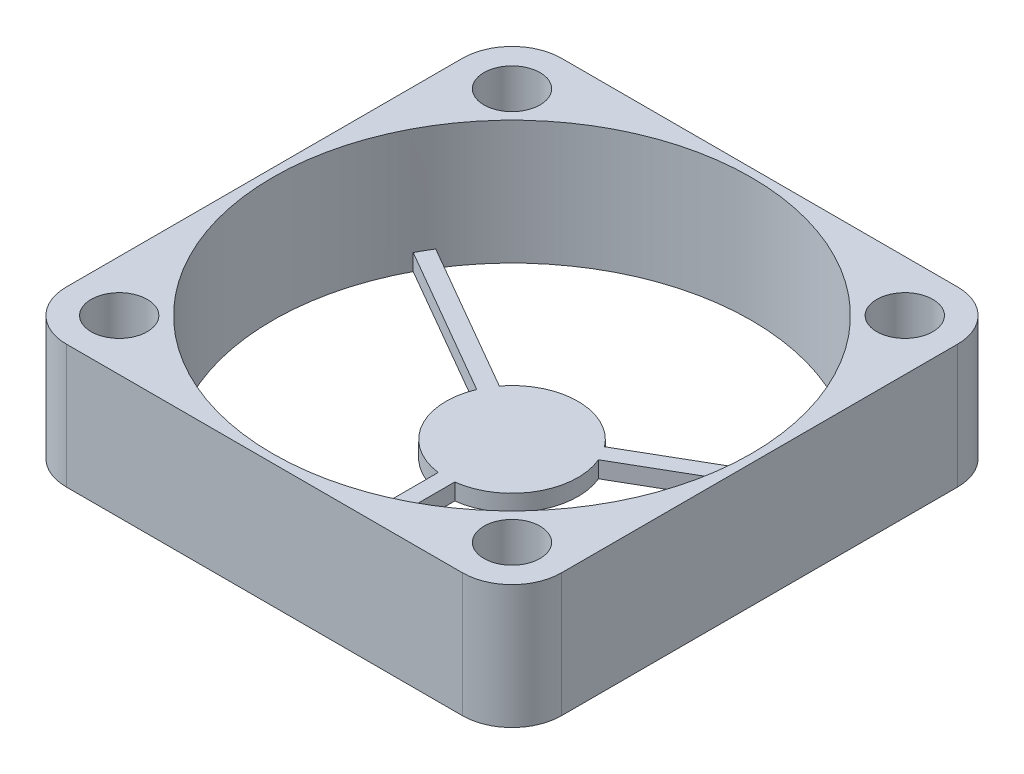
ISO-10303-21;
HEADER;
FILE_DESCRIPTION(('STEP AP214'),'2;1');
FILE_NAME('part.step','',(''),(''),'','','');
FILE_SCHEMA(('AUTOMOTIVE_DESIGN { 1 0 10303 214 1 1 1 1 }'));
ENDSEC;
DATA;
#1=APPLICATION_CONTEXT('core data for automotive mechanical design processes');
#2=APPLICATION_PROTOCOL_DEFINITION('international standard','automotive_design',2000,#1);
#3=PRODUCT_CONTEXT('',#1,'mechanical');
#4=PRODUCT('Part','Part','',(#3));
#5=PRODUCT_RELATED_PRODUCT_CATEGORY('part','',(#4));
#6=PRODUCT_DEFINITION_FORMATION('','',#4);
#7=PRODUCT_DEFINITION_CONTEXT('part definition',#1,'design');
#8=PRODUCT_DEFINITION('design','',#6,#7);
#9=PRODUCT_DEFINITION_SHAPE('','',#8);
#10=(LENGTH_UNIT() NAMED_UNIT(*) SI_UNIT(.MILLI.,.METRE.));
#11=(NAMED_UNIT(*) PLANE_ANGLE_UNIT() SI_UNIT($,.RADIAN.));
#12=(NAMED_UNIT(*) SI_UNIT($,.STERADIAN.) SOLID_ANGLE_UNIT());
#13=UNCERTAINTY_MEASURE_WITH_UNIT(LENGTH_MEASURE(1.E-05),#10,'distance_accuracy_value','');
#14=(GEOMETRIC_REPRESENTATION_CONTEXT(3) GLOBAL_UNCERTAINTY_ASSIGNED_CONTEXT((#13)) GLOBAL_UNIT_ASSIGNED_CONTEXT((#10,
#11,#12)) REPRESENTATION_CONTEXT('',''));
#15=CARTESIAN_POINT('',(0.,0.,0.));
#16=DIRECTION('',(0.,0.,1.));
#17=DIRECTION('',(1.,0.,0.));
#18=AXIS2_PLACEMENT_3D('',#15,#16,#17);
#19=CARTESIAN_POINT('',(0.,1.,0.));
#20=DIRECTION('',(0.,-1.,0.));
#21=DIRECTION('',(0.,0.,-1.));
#22=AXIS2_PLACEMENT_3D('',#19,#20,#21);
#23=CYLINDRICAL_SURFACE('',#22,4.);
#24=DIRECTION('',(0.,-1.,0.));
#25=VECTOR('',#24,1.);
#26=CARTESIAN_POINT('',(-3.68693177121545,12.3997456189822,-1.55130078140374));
#27=LINE('',#26,#25);
#28=CARTESIAN_POINT('',(-3.68693177121755,1.,-1.55130078140462));
#29=VERTEX_POINT('',#28);
#30=CARTESIAN_POINT('',(-3.68693177121755,0.,-1.55130078140462));
#31=VERTEX_POINT('',#30);
#32=EDGE_CURVE('E55',#29,#31,#27,.T.);
#33=ORIENTED_EDGE('',*,*,#32,.T.);
#34=CARTESIAN_POINT('',(0.,0.,0.));
#35=DIRECTION('',(0.,-1.,0.));
#36=DIRECTION('',(0.,0.,-1.));
#37=AXIS2_PLACEMENT_3D('',#34,#35,#36);
#38=CIRCLE('',#37,4.);
#39=CARTESIAN_POINT('',(-0.5,0.,3.96862696659689));
#40=VERTEX_POINT('',#39);
#41=EDGE_CURVE('E222',#40,#31,#38,.T.);
#42=ORIENTED_EDGE('',*,*,#41,.F.);
#43=DIRECTION('',(0.,-1.,0.));
#44=VECTOR('',#43,1.);
#45=CARTESIAN_POINT('',(-0.5,12.3997456189822,3.96862696659689));
#46=LINE('',#45,#44);
#47=CARTESIAN_POINT('',(-0.5,1.,3.96862696659689));
#48=VERTEX_POINT('',#47);
#49=EDGE_CURVE('E242',#48,#40,#46,.T.);
#50=ORIENTED_EDGE('',*,*,#49,.F.);
#51=CARTESIAN_POINT('',(0.,1.,0.));
#52=DIRECTION('',(0.,-1.,0.));
#53=DIRECTION('',(0.,0.,-1.));
#54=AXIS2_PLACEMENT_3D('',#51,#52,#53);
#55=CIRCLE('',#54,4.);
#56=EDGE_CURVE('E181',#48,#29,#55,.T.);
#57=ORIENTED_EDGE('',*,*,#56,.T.);
#58=EDGE_LOOP('',(#33,#42,#50,#57));
#59=FACE_BOUND('',#58,.T.);
#60=ADVANCED_FACE('F32',(#59),#23,.T.);
#61=DIRECTION('',(0.,-1.,0.));
#62=VECTOR('',#61,1.);
#63=CARTESIAN_POINT('',(-3.18693177121544,12.3997456189822,-2.41732618518819));
#64=LINE('',#63,#62);
#65=CARTESIAN_POINT('',(-3.18693177121544,1.,-2.41732618518819));
#66=VERTEX_POINT('',#65);
#67=CARTESIAN_POINT('',(-3.18693177121775,0.,-2.41732618518952));
#68=VERTEX_POINT('',#67);
#69=EDGE_CURVE('E184',#66,#68,#64,.T.);
#70=ORIENTED_EDGE('',*,*,#69,.F.);
#71=CARTESIAN_POINT('',(3.18693177121775,1.,-2.41732618518952));
#72=VERTEX_POINT('',#71);
#73=EDGE_CURVE('E170',#66,#72,#55,.T.);
#74=ORIENTED_EDGE('',*,*,#73,.T.);
#75=DIRECTION('',(0.,-1.,0.));
#76=VECTOR('',#75,1.);
#77=CARTESIAN_POINT('',(3.18693177121545,12.3997456189822,-2.41732618518819));
#78=LINE('',#77,#76);
#79=CARTESIAN_POINT('',(3.18693177121755,0.,-2.41732618518978));
#80=VERTEX_POINT('',#79);
#81=EDGE_CURVE('E212',#72,#80,#78,.T.);
#82=ORIENTED_EDGE('',*,*,#81,.T.);
#83=EDGE_CURVE('E47',#68,#80,#38,.T.);
#84=ORIENTED_EDGE('',*,*,#83,.F.);
#85=EDGE_LOOP('',(#70,#74,#82,#84));
#86=FACE_BOUND('',#85,.T.);
#87=ADVANCED_FACE('F185',(#86),#23,.T.);
#88=CARTESIAN_POINT('',(-12.,7.5,12.));
#89=DIRECTION('',(0.,-1.,0.));
#90=DIRECTION('',(0.,0.,-1.));
#91=AXIS2_PLACEMENT_3D('',#88,#89,#90);
#92=PLANE('',#91);
#93=CARTESIAN_POINT('',(0.,7.5,0.));
#94=DIRECTION('',(0.,1.,0.));
#95=DIRECTION('',(0.,0.,1.));
#96=AXIS2_PLACEMENT_3D('',#93,#94,#95);
#97=CIRCLE('',#96,14.5);
#98=CARTESIAN_POINT('',(0.,7.5,14.5));
#99=VERTEX_POINT('',#98);
#100=EDGE_CURVE('E249',#99,#99,#97,.T.);
#101=ORIENTED_EDGE('',*,*,#100,.F.);
#102=EDGE_LOOP('',(#101));
#103=FACE_BOUND('',#102,.T.);
#104=CARTESIAN_POINT('',(-12.,7.5,12.));
#105=DIRECTION('',(0.,1.,0.));
#106=DIRECTION('',(0.,0.,-1.));
#107=AXIS2_PLACEMENT_3D('',#104,#105,#106);
#108=CIRCLE('',#107,3.);
#109=CARTESIAN_POINT('',(-15.,7.5,12.));
#110=VERTEX_POINT('',#109);
#111=CARTESIAN_POINT('',(-12.,7.5,15.));
#112=VERTEX_POINT('',#111);
#113=EDGE_CURVE('E282',#110,#112,#108,.T.);
#114=ORIENTED_EDGE('',*,*,#113,.T.);
#115=DIRECTION('',(1.,0.,0.));
#116=VECTOR('',#115,1.);
#117=CARTESIAN_POINT('',(-12.,7.5,15.));
#118=LINE('',#117,#116);
#119=CARTESIAN_POINT('',(12.,7.5,15.));
#120=VERTEX_POINT('',#119);
#121=EDGE_CURVE('E285',#112,#120,#118,.T.);
#122=ORIENTED_EDGE('',*,*,#121,.T.);
#123=CARTESIAN_POINT('',(12.,7.5,12.));
#124=DIRECTION('',(0.,1.,0.));
#125=DIRECTION('',(0.,0.,1.));
#126=AXIS2_PLACEMENT_3D('',#123,#124,#125);
#127=CIRCLE('',#126,3.);
#128=CARTESIAN_POINT('',(15.,7.5,12.));
#129=VERTEX_POINT('',#128);
#130=EDGE_CURVE('E288',#120,#129,#127,.T.);
#131=ORIENTED_EDGE('',*,*,#130,.T.);
#132=DIRECTION('',(0.,0.,-1.));
#133=VECTOR('',#132,1.);
#134=CARTESIAN_POINT('',(15.,7.5,12.));
#135=LINE('',#134,#133);
#136=CARTESIAN_POINT('',(15.,7.5,-12.));
#137=VERTEX_POINT('',#136);
#138=EDGE_CURVE('E290',#129,#137,#135,.T.);
#139=ORIENTED_EDGE('',*,*,#138,.T.);
#140=CARTESIAN_POINT('',(12.,7.5,-12.));
#141=DIRECTION('',(0.,1.,0.));
#142=DIRECTION('',(0.,0.,1.));
#143=AXIS2_PLACEMENT_3D('',#140,#141,#142);
#144=CIRCLE('',#143,3.);
#145=CARTESIAN_POINT('',(12.,7.5,-15.));
#146=VERTEX_POINT('',#145);
#147=EDGE_CURVE('E292',#137,#146,#144,.T.);
#148=ORIENTED_EDGE('',*,*,#147,.T.);
#149=DIRECTION('',(-1.,0.,0.));
#150=VECTOR('',#149,1.);
#151=CARTESIAN_POINT('',(-12.,7.5,-15.));
#152=LINE('',#151,#150);
#153=CARTESIAN_POINT('',(-12.,7.5,-15.));
#154=VERTEX_POINT('',#153);
#155=EDGE_CURVE('E294',#146,#154,#152,.T.);
#156=ORIENTED_EDGE('',*,*,#155,.T.);
#157=CARTESIAN_POINT('',(-12.,7.5,-12.));
#158=DIRECTION('',(0.,1.,0.));
#159=DIRECTION('',(0.,0.,1.));
#160=AXIS2_PLACEMENT_3D('',#157,#158,#159);
#161=CIRCLE('',#160,3.);
#162=CARTESIAN_POINT('',(-15.,7.5,-12.));
#163=VERTEX_POINT('',#162);
#164=EDGE_CURVE('E296',#154,#163,#161,.T.);
#165=ORIENTED_EDGE('',*,*,#164,.T.);
#166=DIRECTION('',(0.,0.,1.));
#167=VECTOR('',#166,1.);
#168=CARTESIAN_POINT('',(-15.,7.5,12.));
#169=LINE('',#168,#167);
#170=EDGE_CURVE('E298',#163,#110,#169,.T.);
#171=ORIENTED_EDGE('',*,*,#170,.T.);
#172=EDGE_LOOP('',(#114,#122,#131,#139,#148,#156,#165,#171));
#173=FACE_BOUND('',#172,.T.);
#174=CARTESIAN_POINT('',(-11.9,7.5,-11.9));
#175=DIRECTION('',(0.,1.,0.));
#176=DIRECTION('',(0.,0.,1.));
#177=AXIS2_PLACEMENT_3D('',#174,#175,#176);
#178=CIRCLE('',#177,1.7);
#179=CARTESIAN_POINT('',(-11.9,7.5,-10.2));
#180=VERTEX_POINT('',#179);
#181=EDGE_CURVE('E276',#180,#180,#178,.T.);
#182=ORIENTED_EDGE('',*,*,#181,.F.);
#183=EDGE_LOOP('',(#182));
#184=FACE_BOUND('',#183,.T.);
#185=CARTESIAN_POINT('',(11.9,7.5,-11.9));
#186=DIRECTION('',(0.,1.,0.));
#187=DIRECTION('',(0.,0.,1.));
#188=AXIS2_PLACEMENT_3D('',#185,#186,#187);
#189=CIRCLE('',#188,1.7);
#190=CARTESIAN_POINT('',(11.9,7.5,-10.2));
#191=VERTEX_POINT('',#190);
#192=EDGE_CURVE('E270',#191,#191,#189,.T.);
#193=ORIENTED_EDGE('',*,*,#192,.F.);
#194=EDGE_LOOP('',(#193));
#195=FACE_BOUND('',#194,.T.);
#196=CARTESIAN_POINT('',(11.9,7.5,11.9));
#197=DIRECTION('',(0.,1.,0.));
#198=DIRECTION('',(0.,0.,1.));
#199=AXIS2_PLACEMENT_3D('',#196,#197,#198);
#200=CIRCLE('',#199,1.7);
#201=CARTESIAN_POINT('',(11.9,7.5,13.6));
#202=VERTEX_POINT('',#201);
#203=EDGE_CURVE('E264',#202,#202,#200,.T.);
#204=ORIENTED_EDGE('',*,*,#203,.F.);
#205=EDGE_LOOP('',(#204));
#206=FACE_BOUND('',#205,.T.);
#207=CARTESIAN_POINT('',(-11.9,7.5,11.9));
#208=DIRECTION('',(0.,1.,0.));
#209=DIRECTION('',(0.,0.,1.));
#210=AXIS2_PLACEMENT_3D('',#207,#208,#209);
#211=CIRCLE('',#210,1.7);
#212=CARTESIAN_POINT('',(-11.9,7.5,13.6));
#213=VERTEX_POINT('',#212);
#214=EDGE_CURVE('E258',#213,#213,#211,.T.);
#215=ORIENTED_EDGE('',*,*,#214,.F.);
#216=EDGE_LOOP('',(#215));
#217=FACE_BOUND('',#216,.T.);
#218=ADVANCED_FACE('F357',(#103,#173,#184,#195,#206,#217),#92,.F.);
#219=CARTESIAN_POINT('',(-12.,0.,12.));
#220=DIRECTION('',(0.,-1.,0.));
#221=DIRECTION('',(0.,0.,-1.));
#222=AXIS2_PLACEMENT_3D('',#219,#220,#221);
#223=PLANE('',#222);
#224=ORIENTED_EDGE('',*,*,#41,.T.);
#225=DIRECTION('',(-0.866025403784438,0.,-0.5));
#226=VECTOR('',#225,1.);
#227=CARTESIAN_POINT('',(-12.7999003980097,0.,-6.81267567120002));
#228=LINE('',#227,#226);
#229=CARTESIAN_POINT('',(-12.7999003980118,0.,-6.81267567120116));
#230=VERTEX_POINT('',#229);
#231=EDGE_CURVE('E426',#31,#230,#228,.T.);
#232=ORIENTED_EDGE('',*,*,#231,.T.);
#233=CARTESIAN_POINT('',(0.,0.,0.));
#234=DIRECTION('',(0.,1.,0.));
#235=DIRECTION('',(0.,0.,1.));
#236=AXIS2_PLACEMENT_3D('',#233,#234,#235);
#237=CIRCLE('',#236,14.5);
#238=CARTESIAN_POINT('',(-0.5,0.,14.4913767461894));
#239=VERTEX_POINT('',#238);
#240=EDGE_CURVE('E255',#230,#239,#237,.T.);
#241=ORIENTED_EDGE('',*,*,#240,.T.);
#242=DIRECTION('',(0.,0.,-1.));
#243=VECTOR('',#242,1.);
#244=CARTESIAN_POINT('',(-0.5,0.,14.4913767461894));
#245=LINE('',#244,#243);
#246=EDGE_CURVE('E221',#239,#40,#245,.T.);
#247=ORIENTED_EDGE('',*,*,#246,.T.);
#248=EDGE_LOOP('',(#224,#232,#241,#247));
#249=FACE_BOUND('',#248,.T.);
#250=CARTESIAN_POINT('',(0.499999999999986,0.,14.4913767461894));
#251=VERTEX_POINT('',#250);
#252=CARTESIAN_POINT('',(12.7999003980119,0.,-6.81267567120116));
#253=VERTEX_POINT('',#252);
#254=EDGE_CURVE('E250',#251,#253,#237,.T.);
#255=ORIENTED_EDGE('',*,*,#254,.T.);
#256=DIRECTION('',(-0.866025403784439,0.,0.5));
#257=VECTOR('',#256,1.);
#258=CARTESIAN_POINT('',(12.7999003980097,0.,-6.81267567120002));
#259=LINE('',#258,#257);
#260=CARTESIAN_POINT('',(3.68693177121744,0.,-1.55130078140489));
#261=VERTEX_POINT('',#260);
#262=EDGE_CURVE('E192',#253,#261,#259,.T.);
#263=ORIENTED_EDGE('',*,*,#262,.T.);
#264=CARTESIAN_POINT('',(0.499999999999986,0.,3.96862696659689));
#265=VERTEX_POINT('',#264);
#266=EDGE_CURVE('E219',#261,#265,#38,.T.);
#267=ORIENTED_EDGE('',*,*,#266,.T.);
#268=DIRECTION('',(0.,0.,1.));
#269=VECTOR('',#268,1.);
#270=CARTESIAN_POINT('',(0.499999999999986,0.,14.4913767461894));
#271=LINE('',#270,#269);
#272=EDGE_CURVE('E233',#265,#251,#271,.T.);
#273=ORIENTED_EDGE('',*,*,#272,.T.);
#274=EDGE_LOOP('',(#255,#263,#267,#273));
#275=FACE_BOUND('',#274,.T.);
#276=DIRECTION('',(0.866025403784439,0.,-0.5));
#277=VECTOR('',#276,1.);
#278=CARTESIAN_POINT('',(12.2999003980097,0.,-7.67870107498447));
#279=LINE('',#278,#277);
#280=CARTESIAN_POINT('',(12.2999003980118,0.,-7.6787010749858));
#281=VERTEX_POINT('',#280);
#282=EDGE_CURVE('E196',#80,#281,#279,.T.);
#283=ORIENTED_EDGE('',*,*,#282,.T.);
#284=CARTESIAN_POINT('',(-12.2999003980118,0.,-7.67870107498581));
#285=VERTEX_POINT('',#284);
#286=EDGE_CURVE('E254',#281,#285,#237,.T.);
#287=ORIENTED_EDGE('',*,*,#286,.T.);
#288=DIRECTION('',(0.866025403784438,0.,0.5));
#289=VECTOR('',#288,1.);
#290=CARTESIAN_POINT('',(-12.2999003980097,0.,-7.67870107498447));
#291=LINE('',#290,#289);
#292=EDGE_CURVE('E418',#285,#68,#291,.T.);
#293=ORIENTED_EDGE('',*,*,#292,.T.);
#294=ORIENTED_EDGE('',*,*,#83,.T.);
#295=EDGE_LOOP('',(#283,#287,#293,#294));
#296=FACE_BOUND('',#295,.T.);
#297=CARTESIAN_POINT('',(11.9,0.,11.9));
#298=DIRECTION('',(0.,1.,0.));
#299=DIRECTION('',(0.,0.,1.));
#300=AXIS2_PLACEMENT_3D('',#297,#298,#299);
#301=CIRCLE('',#300,1.7);
#302=CARTESIAN_POINT('',(11.9,0.,13.6));
#303=VERTEX_POINT('',#302);
#304=EDGE_CURVE('E261',#303,#303,#301,.T.);
#305=ORIENTED_EDGE('',*,*,#304,.T.);
#306=EDGE_LOOP('',(#305));
#307=FACE_BOUND('',#306,.T.);
#308=CARTESIAN_POINT('',(-11.9,0.,-11.9));
#309=DIRECTION('',(0.,1.,0.));
#310=DIRECTION('',(0.,0.,1.));
#311=AXIS2_PLACEMENT_3D('',#308,#309,#310);
#312=CIRCLE('',#311,1.7);
#313=CARTESIAN_POINT('',(-11.9,0.,-10.2));
#314=VERTEX_POINT('',#313);
#315=EDGE_CURVE('E273',#314,#314,#312,.T.);
#316=ORIENTED_EDGE('',*,*,#315,.T.);
#317=EDGE_LOOP('',(#316));
#318=FACE_BOUND('',#317,.T.);
#319=CARTESIAN_POINT('',(-12.,0.,12.));
#320=DIRECTION('',(0.,1.,0.));
#321=DIRECTION('',(0.,0.,-1.));
#322=AXIS2_PLACEMENT_3D('',#319,#320,#321);
#323=CIRCLE('',#322,3.);
#324=CARTESIAN_POINT('',(-15.,0.,12.));
#325=VERTEX_POINT('',#324);
#326=CARTESIAN_POINT('',(-12.,0.,15.));
#327=VERTEX_POINT('',#326);
#328=EDGE_CURVE('E279',#325,#327,#323,.T.);
#329=ORIENTED_EDGE('',*,*,#328,.F.);
#330=DIRECTION('',(0.,0.,1.));
#331=VECTOR('',#330,1.);
#332=CARTESIAN_POINT('',(-15.,0.,12.));
#333=LINE('',#332,#331);
#334=CARTESIAN_POINT('',(-15.,0.,-12.));
#335=VERTEX_POINT('',#334);
#336=EDGE_CURVE('E286',#335,#325,#333,.T.);
#337=ORIENTED_EDGE('',*,*,#336,.F.);
#338=CARTESIAN_POINT('',(-12.,0.,-12.));
#339=DIRECTION('',(0.,1.,0.));
#340=DIRECTION('',(0.,0.,1.));
#341=AXIS2_PLACEMENT_3D('',#338,#339,#340);
#342=CIRCLE('',#341,3.);
#343=CARTESIAN_POINT('',(-12.,0.,-15.));
#344=VERTEX_POINT('',#343);
#345=EDGE_CURVE('E313',#344,#335,#342,.T.);
#346=ORIENTED_EDGE('',*,*,#345,.F.);
#347=DIRECTION('',(-1.,0.,0.));
#348=VECTOR('',#347,1.);
#349=CARTESIAN_POINT('',(-12.,0.,-15.));
#350=LINE('',#349,#348);
#351=CARTESIAN_POINT('',(12.,0.,-15.));
#352=VERTEX_POINT('',#351);
#353=EDGE_CURVE('E311',#352,#344,#350,.T.);
#354=ORIENTED_EDGE('',*,*,#353,.F.);
#355=CARTESIAN_POINT('',(12.,0.,-12.));
#356=DIRECTION('',(0.,1.,0.));
#357=DIRECTION('',(0.,0.,1.));
#358=AXIS2_PLACEMENT_3D('',#355,#356,#357);
#359=CIRCLE('',#358,3.);
#360=CARTESIAN_POINT('',(15.,0.,-12.));
#361=VERTEX_POINT('',#360);
#362=EDGE_CURVE('E309',#361,#352,#359,.T.);
#363=ORIENTED_EDGE('',*,*,#362,.F.);
#364=DIRECTION('',(0.,0.,-1.));
#365=VECTOR('',#364,1.);
#366=CARTESIAN_POINT('',(15.,0.,12.));
#367=LINE('',#366,#365);
#368=CARTESIAN_POINT('',(15.,0.,12.));
#369=VERTEX_POINT('',#368);
#370=EDGE_CURVE('E307',#369,#361,#367,.T.);
#371=ORIENTED_EDGE('',*,*,#370,.F.);
#372=CARTESIAN_POINT('',(12.,0.,12.));
#373=DIRECTION('',(0.,1.,0.));
#374=DIRECTION('',(0.,0.,1.));
#375=AXIS2_PLACEMENT_3D('',#372,#373,#374);
#376=CIRCLE('',#375,3.);
#377=CARTESIAN_POINT('',(12.,0.,15.));
#378=VERTEX_POINT('',#377);
#379=EDGE_CURVE('E305',#378,#369,#376,.T.);
#380=ORIENTED_EDGE('',*,*,#379,.F.);
#381=DIRECTION('',(1.,0.,0.));
#382=VECTOR('',#381,1.);
#383=CARTESIAN_POINT('',(-12.,0.,15.));
#384=LINE('',#383,#382);
#385=EDGE_CURVE('E303',#327,#378,#384,.T.);
#386=ORIENTED_EDGE('',*,*,#385,.F.);
#387=EDGE_LOOP('',(#329,#337,#346,#354,#363,#371,#380,#386));
#388=FACE_BOUND('',#387,.T.);
#389=CARTESIAN_POINT('',(11.9,0.,-11.9));
#390=DIRECTION('',(0.,1.,0.));
#391=DIRECTION('',(0.,0.,1.));
#392=AXIS2_PLACEMENT_3D('',#389,#390,#391);
#393=CIRCLE('',#392,1.7);
#394=CARTESIAN_POINT('',(11.9,0.,-10.2));
#395=VERTEX_POINT('',#394);
#396=EDGE_CURVE('E267',#395,#395,#393,.T.);
#397=ORIENTED_EDGE('',*,*,#396,.T.);
#398=EDGE_LOOP('',(#397));
#399=FACE_BOUND('',#398,.T.);
#400=CARTESIAN_POINT('',(-11.9,0.,11.9));
#401=DIRECTION('',(0.,1.,0.));
#402=DIRECTION('',(0.,0.,1.));
#403=AXIS2_PLACEMENT_3D('',#400,#401,#402);
#404=CIRCLE('',#403,1.7);
#405=CARTESIAN_POINT('',(-11.9,0.,13.6));
#406=VERTEX_POINT('',#405);
#407=EDGE_CURVE('E253',#406,#406,#404,.T.);
#408=ORIENTED_EDGE('',*,*,#407,.T.);
#409=EDGE_LOOP('',(#408));
#410=FACE_BOUND('',#409,.T.);
#411=ADVANCED_FACE('F343',(#249,#275,#296,#307,#318,#388,#399,#410),#223,.T.);
#412=CARTESIAN_POINT('',(-12.,7.5,12.));
#413=DIRECTION('',(0.,-1.,0.));
#414=DIRECTION('',(0.,0.,-1.));
#415=AXIS2_PLACEMENT_3D('',#412,#413,#414);
#416=CYLINDRICAL_SURFACE('',#415,3.);
#417=ORIENTED_EDGE('',*,*,#328,.T.);
#418=DIRECTION('',(0.,-1.,0.));
#419=VECTOR('',#418,1.);
#420=CARTESIAN_POINT('',(-12.,7.5,15.));
#421=LINE('',#420,#419);
#422=EDGE_CURVE('E11',#112,#327,#421,.T.);
#423=ORIENTED_EDGE('',*,*,#422,.F.);
#424=ORIENTED_EDGE('',*,*,#113,.F.);
#425=DIRECTION('',(0.,-1.,0.));
#426=VECTOR('',#425,1.);
#427=CARTESIAN_POINT('',(-15.,7.5,12.));
#428=LINE('',#427,#426);
#429=EDGE_CURVE('E300',#110,#325,#428,.T.);
#430=ORIENTED_EDGE('',*,*,#429,.T.);
#431=EDGE_LOOP('',(#417,#423,#424,#430));
#432=FACE_BOUND('',#431,.T.);
#433=ADVANCED_FACE('F34',(#432),#416,.T.);
#434=CARTESIAN_POINT('',(-12.,7.5,15.));
#435=DIRECTION('',(0.,0.,-1.));
#436=DIRECTION('',(-1.,0.,0.));
#437=AXIS2_PLACEMENT_3D('',#434,#435,#436);
#438=PLANE('',#437);
#439=ORIENTED_EDGE('',*,*,#385,.T.);
#440=DIRECTION('',(0.,-1.,0.));
#441=VECTOR('',#440,1.);
#442=CARTESIAN_POINT('',(12.,7.5,15.));
#443=LINE('',#442,#441);
#444=EDGE_CURVE('E40',#120,#378,#443,.T.);
#445=ORIENTED_EDGE('',*,*,#444,.F.);
#446=ORIENTED_EDGE('',*,*,#121,.F.);
#447=ORIENTED_EDGE('',*,*,#422,.T.);
#448=EDGE_LOOP('',(#439,#445,#446,#447));
#449=FACE_BOUND('',#448,.T.);
#450=ADVANCED_FACE('F362',(#449),#438,.F.);
#451=CARTESIAN_POINT('',(12.,7.5,12.));
#452=DIRECTION('',(0.,-1.,0.));
#453=DIRECTION('',(0.,0.,-1.));
#454=AXIS2_PLACEMENT_3D('',#451,#452,#453);
#455=CYLINDRICAL_SURFACE('',#454,3.);
#456=ORIENTED_EDGE('',*,*,#379,.T.);
#457=DIRECTION('',(0.,-1.,0.));
#458=VECTOR('',#457,1.);
#459=CARTESIAN_POINT('',(15.,7.5,12.));
#460=LINE('',#459,#458);
#461=EDGE_CURVE('E330',#129,#369,#460,.T.);
#462=ORIENTED_EDGE('',*,*,#461,.F.);
#463=ORIENTED_EDGE('',*,*,#130,.F.);
#464=ORIENTED_EDGE('',*,*,#444,.T.);
#465=EDGE_LOOP('',(#456,#462,#463,#464));
#466=FACE_BOUND('',#465,.T.);
#467=ADVANCED_FACE('F337',(#466),#455,.T.);
#468=CARTESIAN_POINT('',(15.,7.5,12.));
#469=DIRECTION('',(-1.,0.,0.));
#470=DIRECTION('',(0.,0.,1.));
#471=AXIS2_PLACEMENT_3D('',#468,#469,#470);
#472=PLANE('',#471);
#473=ORIENTED_EDGE('',*,*,#370,.T.);
#474=DIRECTION('',(0.,-1.,0.));
#475=VECTOR('',#474,1.);
#476=CARTESIAN_POINT('',(15.,7.5,-12.));
#477=LINE('',#476,#475);
#478=EDGE_CURVE('E327',#137,#361,#477,.T.);
#479=ORIENTED_EDGE('',*,*,#478,.F.);
#480=ORIENTED_EDGE('',*,*,#138,.F.);
#481=ORIENTED_EDGE('',*,*,#461,.T.);
#482=EDGE_LOOP('',(#473,#479,#480,#481));
#483=FACE_BOUND('',#482,.T.);
#484=ADVANCED_FACE('F349',(#483),#472,.F.);
#485=CARTESIAN_POINT('',(12.,7.5,-12.));
#486=DIRECTION('',(0.,-1.,0.));
#487=DIRECTION('',(0.,0.,-1.));
#488=AXIS2_PLACEMENT_3D('',#485,#486,#487);
#489=CYLINDRICAL_SURFACE('',#488,3.);
#490=ORIENTED_EDGE('',*,*,#362,.T.);
#491=DIRECTION('',(0.,-1.,0.));
#492=VECTOR('',#491,1.);
#493=CARTESIAN_POINT('',(12.,7.5,-15.));
#494=LINE('',#493,#492);
#495=EDGE_CURVE('E324',#146,#352,#494,.T.);
#496=ORIENTED_EDGE('',*,*,#495,.F.);
#497=ORIENTED_EDGE('',*,*,#147,.F.);
#498=ORIENTED_EDGE('',*,*,#478,.T.);
#499=EDGE_LOOP('',(#490,#496,#497,#498));
#500=FACE_BOUND('',#499,.T.);
#501=ADVANCED_FACE('F353',(#500),#489,.T.);
#502=CARTESIAN_POINT('',(-12.,7.5,-15.));
#503=DIRECTION('',(0.,0.,1.));
#504=DIRECTION('',(1.,0.,0.));
#505=AXIS2_PLACEMENT_3D('',#502,#503,#504);
#506=PLANE('',#505);
#507=ORIENTED_EDGE('',*,*,#353,.T.);
#508=DIRECTION('',(0.,-1.,0.));
#509=VECTOR('',#508,1.);
#510=CARTESIAN_POINT('',(-12.,7.5,-15.));
#511=LINE('',#510,#509);
#512=EDGE_CURVE('E321',#154,#344,#511,.T.);
#513=ORIENTED_EDGE('',*,*,#512,.F.);
#514=ORIENTED_EDGE('',*,*,#155,.F.);
#515=ORIENTED_EDGE('',*,*,#495,.T.);
#516=EDGE_LOOP('',(#507,#513,#514,#515));
#517=FACE_BOUND('',#516,.T.);
#518=ADVANCED_FACE('F375',(#517),#506,.F.);
#519=CARTESIAN_POINT('',(-12.,7.5,-12.));
#520=DIRECTION('',(0.,-1.,0.));
#521=DIRECTION('',(0.,0.,-1.));
#522=AXIS2_PLACEMENT_3D('',#519,#520,#521);
#523=CYLINDRICAL_SURFACE('',#522,3.);
#524=ORIENTED_EDGE('',*,*,#345,.T.);
#525=DIRECTION('',(0.,-1.,0.));
#526=VECTOR('',#525,1.);
#527=CARTESIAN_POINT('',(-15.,7.5,-12.));
#528=LINE('',#527,#526);
#529=EDGE_CURVE('E318',#163,#335,#528,.T.);
#530=ORIENTED_EDGE('',*,*,#529,.F.);
#531=ORIENTED_EDGE('',*,*,#164,.F.);
#532=ORIENTED_EDGE('',*,*,#512,.T.);
#533=EDGE_LOOP('',(#524,#530,#531,#532));
#534=FACE_BOUND('',#533,.T.);
#535=ADVANCED_FACE('F373',(#534),#523,.T.);
#536=CARTESIAN_POINT('',(-15.,7.5,12.));
#537=DIRECTION('',(1.,0.,0.));
#538=DIRECTION('',(0.,0.,-1.));
#539=AXIS2_PLACEMENT_3D('',#536,#537,#538);
#540=PLANE('',#539);
#541=ORIENTED_EDGE('',*,*,#336,.T.);
#542=ORIENTED_EDGE('',*,*,#429,.F.);
#543=ORIENTED_EDGE('',*,*,#170,.F.);
#544=ORIENTED_EDGE('',*,*,#529,.T.);
#545=EDGE_LOOP('',(#541,#542,#543,#544));
#546=FACE_BOUND('',#545,.T.);
#547=ADVANCED_FACE('F368',(#546),#540,.F.);
#548=CARTESIAN_POINT('',(-11.9,7.5,-11.9));
#549=DIRECTION('',(0.,-1.,0.));
#550=DIRECTION('',(0.,0.,-1.));
#551=AXIS2_PLACEMENT_3D('',#548,#549,#550);
#552=CYLINDRICAL_SURFACE('',#551,1.7);
#553=ORIENTED_EDGE('',*,*,#181,.T.);
#554=EDGE_LOOP('',(#553));
#555=FACE_BOUND('',#554,.T.);
#556=ORIENTED_EDGE('',*,*,#315,.F.);
#557=EDGE_LOOP('',(#556));
#558=FACE_BOUND('',#557,.T.);
#559=ADVANCED_FACE('F554',(#555,#558),#552,.F.);
#560=CARTESIAN_POINT('',(11.9,7.5,-11.9));
#561=DIRECTION('',(0.,-1.,0.));
#562=DIRECTION('',(0.,0.,-1.));
#563=AXIS2_PLACEMENT_3D('',#560,#561,#562);
#564=CYLINDRICAL_SURFACE('',#563,1.7);
#565=ORIENTED_EDGE('',*,*,#192,.T.);
#566=EDGE_LOOP('',(#565));
#567=FACE_BOUND('',#566,.T.);
#568=ORIENTED_EDGE('',*,*,#396,.F.);
#569=EDGE_LOOP('',(#568));
#570=FACE_BOUND('',#569,.T.);
#571=ADVANCED_FACE('F544',(#567,#570),#564,.F.);
#572=CARTESIAN_POINT('',(11.9,7.5,11.9));
#573=DIRECTION('',(0.,-1.,0.));
#574=DIRECTION('',(0.,0.,-1.));
#575=AXIS2_PLACEMENT_3D('',#572,#573,#574);
#576=CYLINDRICAL_SURFACE('',#575,1.7);
#577=ORIENTED_EDGE('',*,*,#203,.T.);
#578=EDGE_LOOP('',(#577));
#579=FACE_BOUND('',#578,.T.);
#580=ORIENTED_EDGE('',*,*,#304,.F.);
#581=EDGE_LOOP('',(#580));
#582=FACE_BOUND('',#581,.T.);
#583=ADVANCED_FACE('F534',(#579,#582),#576,.F.);
#584=CARTESIAN_POINT('',(-11.9,7.5,11.9));
#585=DIRECTION('',(0.,-1.,0.));
#586=DIRECTION('',(0.,0.,-1.));
#587=AXIS2_PLACEMENT_3D('',#584,#585,#586);
#588=CYLINDRICAL_SURFACE('',#587,1.7);
#589=ORIENTED_EDGE('',*,*,#214,.T.);
#590=EDGE_LOOP('',(#589));
#591=FACE_BOUND('',#590,.T.);
#592=ORIENTED_EDGE('',*,*,#407,.F.);
#593=EDGE_LOOP('',(#592));
#594=FACE_BOUND('',#593,.T.);
#595=ADVANCED_FACE('F494',(#591,#594),#588,.F.);
#596=CARTESIAN_POINT('',(0.,0.,0.));
#597=DIRECTION('',(0.,1.,0.));
#598=DIRECTION('',(0.,0.,1.));
#599=AXIS2_PLACEMENT_3D('',#596,#597,#598);
#600=CYLINDRICAL_SURFACE('',#599,14.5);
#601=ORIENTED_EDGE('',*,*,#240,.F.);
#602=DIRECTION('',(0.,-1.,0.));
#603=VECTOR('',#602,1.);
#604=CARTESIAN_POINT('',(-12.7999003980097,12.3997456189822,-6.81267567120002));
#605=LINE('',#604,#603);
#606=CARTESIAN_POINT('',(-12.7999003980097,1.,-6.81267567120002));
#607=VERTEX_POINT('',#606);
#608=EDGE_CURVE('E436',#607,#230,#605,.T.);
#609=ORIENTED_EDGE('',*,*,#608,.F.);
#610=CARTESIAN_POINT('',(0.,1.,1.65145455995789E-12));
#611=DIRECTION('',(0.,-1.,0.));
#612=DIRECTION('',(0.,0.,-1.));
#613=AXIS2_PLACEMENT_3D('',#610,#611,#612);
#614=CIRCLE('',#613,14.4999999999984);
#615=CARTESIAN_POINT('',(-12.2999003980118,1.,-7.67870107498581));
#616=VERTEX_POINT('',#615);
#617=EDGE_CURVE('E193',#616,#607,#614,.F.);
#618=ORIENTED_EDGE('',*,*,#617,.F.);
#619=DIRECTION('',(0.,-1.,0.));
#620=VECTOR('',#619,1.);
#621=CARTESIAN_POINT('',(-12.2999003980097,12.3997456189822,-7.67870107498447));
#622=LINE('',#621,#620);
#623=EDGE_CURVE('E189',#616,#285,#622,.T.);
#624=ORIENTED_EDGE('',*,*,#623,.T.);
#625=ORIENTED_EDGE('',*,*,#286,.F.);
#626=DIRECTION('',(0.,-1.,0.));
#627=VECTOR('',#626,1.);
#628=CARTESIAN_POINT('',(12.2999003980097,12.3997456189822,-7.67870107498447));
#629=LINE('',#628,#627);
#630=CARTESIAN_POINT('',(12.2999003980097,1.,-7.67870107498447));
#631=VERTEX_POINT('',#630);
#632=EDGE_CURVE('E204',#631,#281,#629,.T.);
#633=ORIENTED_EDGE('',*,*,#632,.F.);
#634=CARTESIAN_POINT('',(0.,1.,1.65145455995789E-12));
#635=DIRECTION('',(0.,-1.,0.));
#636=DIRECTION('',(0.,0.,-1.));
#637=AXIS2_PLACEMENT_3D('',#634,#635,#636);
#638=CIRCLE('',#637,14.4999999999984);
#639=CARTESIAN_POINT('',(12.7999003980119,1.,-6.81267567120116));
#640=VERTEX_POINT('',#639);
#641=EDGE_CURVE('E203',#640,#631,#638,.F.);
#642=ORIENTED_EDGE('',*,*,#641,.F.);
#643=DIRECTION('',(0.,-1.,0.));
#644=VECTOR('',#643,1.);
#645=CARTESIAN_POINT('',(12.7999003980097,12.3997456189822,-6.81267567120002));
#646=LINE('',#645,#644);
#647=EDGE_CURVE('E209',#640,#253,#646,.T.);
#648=ORIENTED_EDGE('',*,*,#647,.T.);
#649=ORIENTED_EDGE('',*,*,#254,.F.);
#650=DIRECTION('',(0.,-1.,0.));
#651=VECTOR('',#650,1.);
#652=CARTESIAN_POINT('',(0.499999999999986,12.3997456189822,14.4913767461894));
#653=LINE('',#652,#651);
#654=CARTESIAN_POINT('',(0.499999999999986,1.,14.4913767461894));
#655=VERTEX_POINT('',#654);
#656=EDGE_CURVE('E228',#655,#251,#653,.T.);
#657=ORIENTED_EDGE('',*,*,#656,.F.);
#658=CARTESIAN_POINT('',(0.,1.,1.65145455995789E-12));
#659=DIRECTION('',(0.,-1.,0.));
#660=DIRECTION('',(0.,0.,-1.));
#661=AXIS2_PLACEMENT_3D('',#658,#659,#660);
#662=CIRCLE('',#661,14.4999999999984);
#663=CARTESIAN_POINT('',(-0.5,1.,14.4913767461894));
#664=VERTEX_POINT('',#663);
#665=EDGE_CURVE('E227',#664,#655,#662,.F.);
#666=ORIENTED_EDGE('',*,*,#665,.F.);
#667=DIRECTION('',(0.,-1.,0.));
#668=VECTOR('',#667,1.);
#669=CARTESIAN_POINT('',(-0.5,12.3997456189822,14.4913767461894));
#670=LINE('',#669,#668);
#671=EDGE_CURVE('E236',#664,#239,#670,.T.);
#672=ORIENTED_EDGE('',*,*,#671,.T.);
#673=EDGE_LOOP('',(#601,#609,#618,#624,#625,#633,#642,#648,#649,#657,#666,#672));
#674=FACE_BOUND('',#673,.T.);
#675=ORIENTED_EDGE('',*,*,#100,.T.);
#676=EDGE_LOOP('',(#675));
#677=FACE_BOUND('',#676,.T.);
#678=ADVANCED_FACE('F420',(#674,#677),#600,.F.);
#679=CARTESIAN_POINT('',(0.499999999999986,12.3997456189822,14.4913767461894));
#680=DIRECTION('',(1.,0.,0.));
#681=DIRECTION('',(0.,0.,-1.));
#682=AXIS2_PLACEMENT_3D('',#679,#680,#681);
#683=PLANE('',#682);
#684=DIRECTION('',(0.,0.,-1.));
#685=VECTOR('',#684,1.);
#686=CARTESIAN_POINT('',(0.499999999999986,1.,14.4913767461894));
#687=LINE('',#686,#685);
#688=CARTESIAN_POINT('',(0.499999999999986,1.,3.96862696659689));
#689=VERTEX_POINT('',#688);
#690=EDGE_CURVE('E224',#655,#689,#687,.T.);
#691=ORIENTED_EDGE('',*,*,#690,.F.);
#692=ORIENTED_EDGE('',*,*,#656,.T.);
#693=ORIENTED_EDGE('',*,*,#272,.F.);
#694=DIRECTION('',(0.,-1.,0.));
#695=VECTOR('',#694,1.);
#696=CARTESIAN_POINT('',(0.499999999999986,12.3997456189822,3.96862696659689));
#697=LINE('',#696,#695);
#698=EDGE_CURVE('E239',#689,#265,#697,.T.);
#699=ORIENTED_EDGE('',*,*,#698,.F.);
#700=EDGE_LOOP('',(#691,#692,#693,#699));
#701=FACE_BOUND('',#700,.T.);
#702=ADVANCED_FACE('F412',(#701),#683,.T.);
#703=CARTESIAN_POINT('',(-0.5,12.3997456189822,14.4913767461894));
#704=DIRECTION('',(-1.,0.,0.));
#705=DIRECTION('',(0.,0.,1.));
#706=AXIS2_PLACEMENT_3D('',#703,#704,#705);
#707=PLANE('',#706);
#708=DIRECTION('',(0.,0.,1.));
#709=VECTOR('',#708,1.);
#710=CARTESIAN_POINT('',(-0.5,1.,14.4913767461894));
#711=LINE('',#710,#709);
#712=EDGE_CURVE('E230',#48,#664,#711,.T.);
#713=ORIENTED_EDGE('',*,*,#712,.F.);
#714=ORIENTED_EDGE('',*,*,#49,.T.);
#715=ORIENTED_EDGE('',*,*,#246,.F.);
#716=ORIENTED_EDGE('',*,*,#671,.F.);
#717=EDGE_LOOP('',(#713,#714,#715,#716));
#718=FACE_BOUND('',#717,.T.);
#719=ADVANCED_FACE('F402',(#718),#707,.T.);
#720=CARTESIAN_POINT('',(0.,1.,0.));
#721=DIRECTION('',(0.,-1.,0.));
#722=DIRECTION('',(0.,0.,-1.));
#723=AXIS2_PLACEMENT_3D('',#720,#721,#722);
#724=PLANE('',#723);
#725=ORIENTED_EDGE('',*,*,#665,.T.);
#726=ORIENTED_EDGE('',*,*,#690,.T.);
#727=CARTESIAN_POINT('',(3.68693177121546,1.,-1.55130078140374));
#728=VERTEX_POINT('',#727);
#729=EDGE_CURVE('E182',#728,#689,#55,.T.);
#730=ORIENTED_EDGE('',*,*,#729,.F.);
#731=DIRECTION('',(0.866025403784439,0.,-0.5));
#732=VECTOR('',#731,1.);
#733=CARTESIAN_POINT('',(12.7999003980097,1.,-6.81267567120002));
#734=LINE('',#733,#732);
#735=EDGE_CURVE('E205',#728,#640,#734,.T.);
#736=ORIENTED_EDGE('',*,*,#735,.T.);
#737=ORIENTED_EDGE('',*,*,#641,.T.);
#738=DIRECTION('',(-0.866025403784439,0.,0.5));
#739=VECTOR('',#738,1.);
#740=CARTESIAN_POINT('',(12.2999003980097,1.,-7.67870107498447));
#741=LINE('',#740,#739);
#742=EDGE_CURVE('E179',#631,#72,#741,.T.);
#743=ORIENTED_EDGE('',*,*,#742,.T.);
#744=ORIENTED_EDGE('',*,*,#73,.F.);
#745=DIRECTION('',(-0.866025403784439,0.,-0.5));
#746=VECTOR('',#745,1.);
#747=CARTESIAN_POINT('',(-12.2999003980097,1.,-7.67870107498447));
#748=LINE('',#747,#746);
#749=EDGE_CURVE('E175',#66,#616,#748,.T.);
#750=ORIENTED_EDGE('',*,*,#749,.T.);
#751=ORIENTED_EDGE('',*,*,#617,.T.);
#752=DIRECTION('',(0.866025403784439,0.,0.5));
#753=VECTOR('',#752,1.);
#754=CARTESIAN_POINT('',(-12.7999003980097,1.,-6.81267567120002));
#755=LINE('',#754,#753);
#756=EDGE_CURVE('E198',#607,#29,#755,.T.);
#757=ORIENTED_EDGE('',*,*,#756,.T.);
#758=ORIENTED_EDGE('',*,*,#56,.F.);
#759=ORIENTED_EDGE('',*,*,#712,.T.);
#760=EDGE_LOOP('',(#725,#726,#730,#736,#737,#743,#744,#750,#751,#757,#758,#759));
#761=FACE_BOUND('',#760,.T.);
#762=ADVANCED_FACE('F172',(#761),#724,.F.);
#763=DIRECTION('',(0.,-1.,0.));
#764=VECTOR('',#763,1.);
#765=CARTESIAN_POINT('',(3.68693177121546,12.3997456189822,-1.55130078140374));
#766=LINE('',#765,#764);
#767=EDGE_CURVE('E214',#728,#261,#766,.T.);
#768=ORIENTED_EDGE('',*,*,#767,.F.);
#769=ORIENTED_EDGE('',*,*,#729,.T.);
#770=ORIENTED_EDGE('',*,*,#698,.T.);
#771=ORIENTED_EDGE('',*,*,#266,.F.);
#772=EDGE_LOOP('',(#768,#769,#770,#771));
#773=FACE_BOUND('',#772,.T.);
#774=ADVANCED_FACE('F386',(#773),#23,.T.);
#775=CARTESIAN_POINT('',(12.2999003980097,12.3997456189822,-7.67870107498447));
#776=DIRECTION('',(-0.5,0.,-0.866025403784439));
#777=DIRECTION('',(-0.866025403784439,0.,0.5));
#778=AXIS2_PLACEMENT_3D('',#775,#776,#777);
#779=PLANE('',#778);
#780=ORIENTED_EDGE('',*,*,#742,.F.);
#781=ORIENTED_EDGE('',*,*,#632,.T.);
#782=ORIENTED_EDGE('',*,*,#282,.F.);
#783=ORIENTED_EDGE('',*,*,#81,.F.);
#784=EDGE_LOOP('',(#780,#781,#782,#783));
#785=FACE_BOUND('',#784,.T.);
#786=ADVANCED_FACE('F393',(#785),#779,.T.);
#787=CARTESIAN_POINT('',(12.7999003980097,12.3997456189822,-6.81267567120002));
#788=DIRECTION('',(0.5,0.,0.866025403784439));
#789=DIRECTION('',(0.866025403784439,0.,-0.5));
#790=AXIS2_PLACEMENT_3D('',#787,#788,#789);
#791=PLANE('',#790);
#792=ORIENTED_EDGE('',*,*,#735,.F.);
#793=ORIENTED_EDGE('',*,*,#767,.T.);
#794=ORIENTED_EDGE('',*,*,#262,.F.);
#795=ORIENTED_EDGE('',*,*,#647,.F.);
#796=EDGE_LOOP('',(#792,#793,#794,#795));
#797=FACE_BOUND('',#796,.T.);
#798=ADVANCED_FACE('F399',(#797),#791,.T.);
#799=CARTESIAN_POINT('',(-12.7999003980097,12.3997456189822,-6.81267567120002));
#800=DIRECTION('',(-0.5,0.,0.866025403784438));
#801=DIRECTION('',(0.866025403784439,0.,0.5));
#802=AXIS2_PLACEMENT_3D('',#799,#800,#801);
#803=PLANE('',#802);
#804=ORIENTED_EDGE('',*,*,#756,.F.);
#805=ORIENTED_EDGE('',*,*,#608,.T.);
#806=ORIENTED_EDGE('',*,*,#231,.F.);
#807=ORIENTED_EDGE('',*,*,#32,.F.);
#808=EDGE_LOOP('',(#804,#805,#806,#807));
#809=FACE_BOUND('',#808,.T.);
#810=ADVANCED_FACE('F435',(#809),#803,.T.);
#811=CARTESIAN_POINT('',(-12.2999003980097,12.3997456189822,-7.67870107498447));
#812=DIRECTION('',(0.5,0.,-0.866025403784438));
#813=DIRECTION('',(-0.866025403784439,0.,-0.5));
#814=AXIS2_PLACEMENT_3D('',#811,#812,#813);
#815=PLANE('',#814);
#816=ORIENTED_EDGE('',*,*,#749,.F.);
#817=ORIENTED_EDGE('',*,*,#69,.T.);
#818=ORIENTED_EDGE('',*,*,#292,.F.);
#819=ORIENTED_EDGE('',*,*,#623,.F.);
#820=EDGE_LOOP('',(#816,#817,#818,#819));
#821=FACE_BOUND('',#820,.T.);
#822=ADVANCED_FACE('F191',(#821),#815,.T.);
#823=CLOSED_SHELL('',(#60,#87,#218,#411,#433,#450,#467,#484,#501,#518,#535,#547,#559,#571,#583,
#595,#678,#702,#719,#762,#774,#786,#798,#810,#822));
#824=MANIFOLD_SOLID_BREP('B2',#823);
#825=ADVANCED_BREP_SHAPE_REPRESENTATION('',(#18,#824),#14);
#826=SHAPE_DEFINITION_REPRESENTATION(#9,#825);
ENDSEC;
END-ISO-10303-21;
